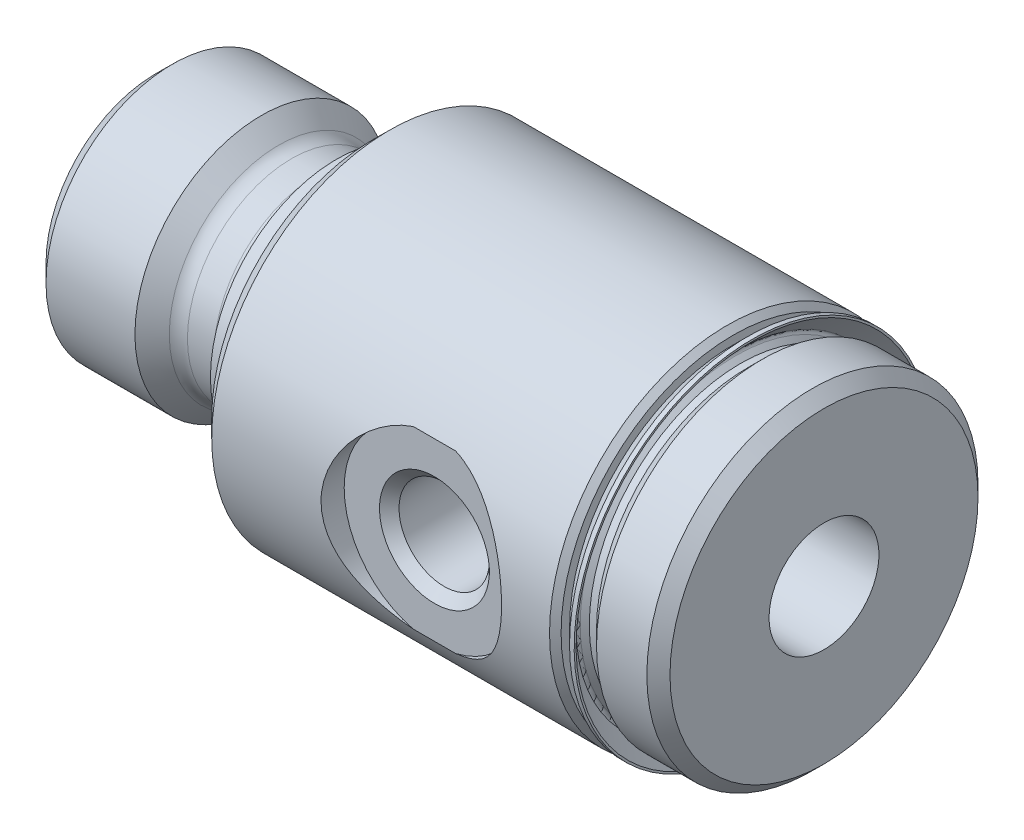
ISO-10303-21;
HEADER;
FILE_DESCRIPTION(('STEP AP214'),'2;1');
FILE_NAME('part.step','',(''),(''),'','','');
FILE_SCHEMA(('AUTOMOTIVE_DESIGN { 1 0 10303 214 1 1 1 1 }'));
ENDSEC;
DATA;
#1=APPLICATION_CONTEXT('core data for automotive mechanical design processes');
#2=APPLICATION_PROTOCOL_DEFINITION('international standard','automotive_design',2000,#1);
#3=PRODUCT_CONTEXT('',#1,'mechanical');
#4=PRODUCT('Part','Part','',(#3));
#5=PRODUCT_RELATED_PRODUCT_CATEGORY('part','',(#4));
#6=PRODUCT_DEFINITION_FORMATION('','',#4);
#7=PRODUCT_DEFINITION_CONTEXT('part definition',#1,'design');
#8=PRODUCT_DEFINITION('design','',#6,#7);
#9=PRODUCT_DEFINITION_SHAPE('','',#8);
#10=(LENGTH_UNIT() NAMED_UNIT(*) SI_UNIT(.MILLI.,.METRE.));
#11=(NAMED_UNIT(*) PLANE_ANGLE_UNIT() SI_UNIT($,.RADIAN.));
#12=(NAMED_UNIT(*) SI_UNIT($,.STERADIAN.) SOLID_ANGLE_UNIT());
#13=UNCERTAINTY_MEASURE_WITH_UNIT(LENGTH_MEASURE(1.E-05),#10,'distance_accuracy_value','');
#14=(GEOMETRIC_REPRESENTATION_CONTEXT(3) GLOBAL_UNCERTAINTY_ASSIGNED_CONTEXT((#13)) GLOBAL_UNIT_ASSIGNED_CONTEXT((#10,
#11,#12)) REPRESENTATION_CONTEXT('',''));
#15=CARTESIAN_POINT('',(0.,0.,0.));
#16=DIRECTION('',(0.,0.,1.));
#17=DIRECTION('',(1.,0.,0.));
#18=AXIS2_PLACEMENT_3D('',#15,#16,#17);
#19=CARTESIAN_POINT('',(29.3624,0.,0.));
#20=DIRECTION('',(-1.,0.,0.));
#21=DIRECTION('',(0.,0.,1.));
#22=AXIS2_PLACEMENT_3D('',#19,#20,#21);
#23=CYLINDRICAL_SURFACE('',#22,6.63575);
#24=CARTESIAN_POINT('',(26.0096,0.,0.));
#25=DIRECTION('',(-1.,0.,0.));
#26=DIRECTION('',(0.,0.,1.));
#27=AXIS2_PLACEMENT_3D('',#24,#25,#26);
#28=CIRCLE('',#27,6.63575);
#29=CARTESIAN_POINT('',(26.0096,0.,6.63575));
#30=VERTEX_POINT('',#29);
#31=EDGE_CURVE('E174',#30,#30,#28,.T.);
#32=ORIENTED_EDGE('',*,*,#31,.T.);
#33=EDGE_LOOP('',(#32));
#34=FACE_BOUND('',#33,.T.);
#35=CARTESIAN_POINT('',(25.6921000000003,-4.56834570172766E-13,0.));
#36=DIRECTION('',(-1.,0.,0.));
#37=DIRECTION('',(0.,-1.,0.));
#38=AXIS2_PLACEMENT_3D('',#35,#36,#37);
#39=CIRCLE('',#38,6.63575);
#40=CARTESIAN_POINT('',(25.6921000000002,-6.63575000000046,0.));
#41=VERTEX_POINT('',#40);
#42=EDGE_CURVE('E42',#41,#41,#39,.T.);
#43=ORIENTED_EDGE('',*,*,#42,.F.);
#44=EDGE_LOOP('',(#43));
#45=FACE_BOUND('',#44,.T.);
#46=ADVANCED_FACE('F34',(#34,#45),#23,.T.);
#47=CARTESIAN_POINT('',(29.3624,0.,0.));
#48=DIRECTION('',(-1.,0.,0.));
#49=DIRECTION('',(0.,0.,1.));
#50=AXIS2_PLACEMENT_3D('',#47,#48,#49);
#51=CYLINDRICAL_SURFACE('',#50,7.8105);
#52=CARTESIAN_POINT('',(10.287,0.,0.));
#53=DIRECTION('',(-1.,0.,0.));
#54=DIRECTION('',(0.,0.,1.));
#55=AXIS2_PLACEMENT_3D('',#52,#53,#54);
#56=CIRCLE('',#55,7.8105);
#57=CARTESIAN_POINT('',(10.287,0.,7.8105));
#58=VERTEX_POINT('',#57);
#59=EDGE_CURVE('E188',#58,#58,#56,.T.);
#60=ORIENTED_EDGE('',*,*,#59,.F.);
#61=EDGE_LOOP('',(#60));
#62=FACE_BOUND('',#61,.T.);
#63=CARTESIAN_POINT('',(25.1206,0.,0.));
#64=DIRECTION('',(-1.,0.,0.));
#65=DIRECTION('',(0.,0.,1.));
#66=AXIS2_PLACEMENT_3D('',#63,#64,#65);
#67=CIRCLE('',#66,7.8105);
#68=CARTESIAN_POINT('',(25.1206,0.,7.8105));
#69=VERTEX_POINT('',#68);
#70=EDGE_CURVE('E185',#69,#69,#67,.T.);
#71=ORIENTED_EDGE('',*,*,#70,.T.);
#72=EDGE_LOOP('',(#71));
#73=FACE_BOUND('',#72,.T.);
#74=DIRECTION('',(-1.,0.,0.));
#75=VECTOR('',#74,1.);
#76=CARTESIAN_POINT('',(29.3624,-3.85210072557819,6.7945));
#77=LINE('',#76,#75);
#78=CARTESIAN_POINT('',(18.1215961223692,-3.85210072557819,6.7945));
#79=VERTEX_POINT('',#78);
#80=CARTESIAN_POINT('',(19.9784038776308,-3.85210072557819,6.7945));
#81=VERTEX_POINT('',#80);
#82=EDGE_CURVE('E72',#79,#81,#77,.F.);
#83=ORIENTED_EDGE('',*,*,#82,.F.);
#84=CARTESIAN_POINT('',(18.1215961223692,3.85210072557819,6.7945));
#85=CARTESIAN_POINT('',(18.0128551494508,3.82589500564141,6.80934433204708));
#86=CARTESIAN_POINT('',(17.9056209649567,3.79517500586059,6.82657399668449));
#87=CARTESIAN_POINT('',(17.6948458436702,3.72511680182272,6.86506038601814));
#88=CARTESIAN_POINT('',(17.5913019230518,3.68578575285989,6.88631376526359));
#89=CARTESIAN_POINT('',(17.2878087065809,3.55577888639684,6.9548471368729));
#90=CARTESIAN_POINT('',(17.0940755421578,3.45286266206164,7.00703729481279));
#91=CARTESIAN_POINT('',(16.7281103611202,3.21817634438967,7.11786553311781));
#92=CARTESIAN_POINT('',(16.5558202225669,3.08648703832435,7.17648533571343));
#93=CARTESIAN_POINT('',(16.2347811190607,2.79677234095305,7.29427484256322));
#94=CARTESIAN_POINT('',(16.0860629837427,2.63871300579142,7.35344516154359));
#95=CARTESIAN_POINT('',(15.8070015488362,2.28841557588024,7.47015661481015));
#96=CARTESIAN_POINT('',(15.6784285339262,2.09464302317267,7.52735477020865));
#97=CARTESIAN_POINT('',(15.4562392511672,1.68511919200369,7.62946016123117));
#98=CARTESIAN_POINT('',(15.3625889509786,1.46938957321629,7.67437935130223));
#99=CARTESIAN_POINT('',(15.222598391159,1.04670163284468,7.74267421743849));
#100=CARTESIAN_POINT('',(15.1721871592955,0.841388849692406,7.76787617373968));
#101=CARTESIAN_POINT('',(15.1046975346992,0.424044677405603,7.80178403706623));
#102=CARTESIAN_POINT('',(15.0876021327686,0.212016772858686,7.81049836168719));
#103=CARTESIAN_POINT('',(15.0875979050919,-0.208253092440596,7.8105016092298));
#104=CARTESIAN_POINT('',(15.104087593126,-0.416495444900189,7.80209711836994));
#105=CARTESIAN_POINT('',(15.1692154971974,-0.826593665158206,7.76936300856744));
#106=CARTESIAN_POINT('',(15.217861199563,-1.02844803428297,7.7450296812023));
#107=CARTESIAN_POINT('',(15.3449093253086,-1.41953626393276,7.68296480855789));
#108=CARTESIAN_POINT('',(15.4232143015947,-1.60880909321737,7.645277165452));
#109=CARTESIAN_POINT('',(15.6067613235194,-1.97130408916965,7.55993347529357));
#110=CARTESIAN_POINT('',(15.7120099406,-2.14452232613126,7.51227499691478));
#111=CARTESIAN_POINT('',(15.9538052593816,-2.48190984333818,7.40790858770927));
#112=CARTESIAN_POINT('',(16.0918793620173,-2.64486639030063,7.35082425979542));
#113=CARTESIAN_POINT('',(16.3921031272662,-2.94644852490168,7.23522519139544));
#114=CARTESIAN_POINT('',(16.5542737306898,-3.08505271842146,7.17670924409722));
#115=CARTESIAN_POINT('',(16.9000859546562,-3.3352651062674,7.06390731868926));
#116=CARTESIAN_POINT('',(17.0837507646518,-3.44684373778793,7.00962601637755));
#117=CARTESIAN_POINT('',(17.3722265046765,-3.59127493866339,6.93610629540564));
#118=CARTESIAN_POINT('',(17.470460770679,-3.63556844811676,6.91293281761722));
#119=CARTESIAN_POINT('',(17.6708258445217,-3.71619801837318,6.86992504364546));
#120=CARTESIAN_POINT('',(17.7729539079885,-3.75253956633275,6.85008844708623));
#121=CARTESIAN_POINT('',(17.9170538936038,-3.79721428881743,6.82534082601764));
#122=CARTESIAN_POINT('',(17.9576644911665,-3.80909600866532,6.81871427962771));
#123=CARTESIAN_POINT('',(18.0393123286186,-3.83156813434324,6.80611204807017));
#124=CARTESIAN_POINT('',(18.0803492748927,-3.84215937221748,6.80013594379516));
#125=CARTESIAN_POINT('',(18.1215961223692,-3.85210072557819,6.7945));
#126=B_SPLINE_CURVE_WITH_KNOTS('',3,(#84,#85,#86,#87,#88,#89,#90,#91,#92,#93,#94,#95,#96,#97,
#98,#99,#100,#101,#102,#103,#104,#105,#106,#107,#108,#109,#110,#111,#112,#113,#114,#115,#116,
#117,#118,#119,#120,#121,#122,#123,#124,#125),.UNSPECIFIED.,.F.,.F.,(4,2,2,2,2,2,2,2,2,2,2,2,2,
2,2,2,2,2,2,2,4),(0.,0.338222818675507,0.676165652849872,1.34921264078913,2.02039363276876,
2.69244533968194,3.40724108890215,4.12133843480017,4.7568840992762,5.39210520461711,
6.01604998873544,6.64014008630427,7.26219724397963,7.88440626359151,8.54490302049852,
9.20597716914358,9.86777122242373,10.1981171851282,10.5282344725933,10.6567002766157,
10.7850828084273),.UNSPECIFIED.);
#127=CARTESIAN_POINT('',(18.1215961223692,3.85210072557819,6.7945));
#128=VERTEX_POINT('',#127);
#129=EDGE_CURVE('E52',#128,#79,#126,.T.);
#130=ORIENTED_EDGE('',*,*,#129,.F.);
#131=DIRECTION('',(-1.,0.,0.));
#132=VECTOR('',#131,1.);
#133=CARTESIAN_POINT('',(29.3624,3.85210072557819,6.7945));
#134=LINE('',#133,#132);
#135=CARTESIAN_POINT('',(19.9784038776308,3.85210072557819,6.7945));
#136=VERTEX_POINT('',#135);
#137=EDGE_CURVE('E68',#136,#128,#134,.T.);
#138=ORIENTED_EDGE('',*,*,#137,.F.);
#139=CARTESIAN_POINT('',(19.9784038776308,-3.85210072557819,6.7945));
#140=CARTESIAN_POINT('',(20.0871441476983,-3.82589544686892,6.80934420874089));
#141=CARTESIAN_POINT('',(20.1943778263773,-3.79517548526653,6.82657379028904));
#142=CARTESIAN_POINT('',(20.4051519641891,-3.72511745285641,6.86505997155541));
#143=CARTESIAN_POINT('',(20.5086954076075,-3.68578653845436,6.88631322530072));
#144=CARTESIAN_POINT('',(20.8121889417393,-3.55578060620908,6.95484648081365));
#145=CARTESIAN_POINT('',(21.0059222633617,-3.45286628823122,7.00703655483552));
#146=CARTESIAN_POINT('',(21.3718946574185,-3.21817091332426,7.11786712811991));
#147=CARTESIAN_POINT('',(21.5441915172288,-3.08647022469434,7.17648944675929));
#148=CARTESIAN_POINT('',(21.8652206001147,-2.79677701729546,7.29427566912562));
#149=CARTESIAN_POINT('',(22.0139229679327,-2.63875169860474,7.35344016037897));
#150=CARTESIAN_POINT('',(22.2930004460401,-2.28839067605302,7.47015651935842));
#151=CARTESIAN_POINT('',(22.4216119254221,-2.0945133665992,7.52736735939915));
#152=CARTESIAN_POINT('',(22.5882521642072,-1.78745629875584,7.60395461709459));
#153=CARTESIAN_POINT('',(22.6394307437685,-1.68236335543616,7.62795130954219));
#154=CARTESIAN_POINT('',(22.7325253651758,-1.467415909354,7.67219678193279));
#155=CARTESIAN_POINT('',(22.7744464910334,-1.35756405994036,7.69244761802928));
#156=CARTESIAN_POINT('',(22.8463423582829,-1.14048258055078,7.72752147938978));
#157=CARTESIAN_POINT('',(22.8768734567333,-1.03347688643543,7.74259314428561));
#158=CARTESIAN_POINT('',(22.9288925199877,-0.816827347829265,7.76843568198634));
#159=CARTESIAN_POINT('',(22.9503849783784,-0.707184842968009,7.77920869174365));
#160=CARTESIAN_POINT('',(22.9840506327867,-0.486160747751186,7.79614258259886));
#161=CARTESIAN_POINT('',(22.9962268423637,-0.374779731663944,7.80230495510138));
#162=CARTESIAN_POINT('',(23.0110970240145,-0.151228170032666,7.80983636785463));
#163=CARTESIAN_POINT('',(23.0137917464325,-0.0390576876692567,7.81120578740914));
#164=CARTESIAN_POINT('',(23.0098626942883,0.174230727152886,7.80921306572696));
#165=CARTESIAN_POINT('',(23.0041134263872,0.275370230556359,7.80629495337318));
#166=CARTESIAN_POINT('',(22.9849140365282,0.476760563041052,7.79658748131316));
#167=CARTESIAN_POINT('',(22.9714614433281,0.577011096453566,7.78979687930726));
#168=CARTESIAN_POINT('',(22.9370107815293,0.77584386949125,7.77251093312911));
#169=CARTESIAN_POINT('',(22.9160156536495,0.87442674364788,7.76201703284431));
#170=CARTESIAN_POINT('',(22.866711471725,1.06932194629943,7.73757915700026));
#171=CARTESIAN_POINT('',(22.8383996096475,1.16563338753836,7.72363385694216));
#172=CARTESIAN_POINT('',(22.7429622417522,1.45000298576464,7.67711751193974));
#173=CARTESIAN_POINT('',(22.6652689288464,1.63387127553528,7.63983166466624));
#174=CARTESIAN_POINT('',(22.4844105074451,1.98613907629759,7.55592978822106));
#175=CARTESIAN_POINT('',(22.3812378745803,2.15453399761335,7.50931100368502));
#176=CARTESIAN_POINT('',(22.1415879893032,2.48767198577415,7.40597608662514));
#177=CARTESIAN_POINT('',(22.0029338281294,2.65068693044985,7.34872708336746));
#178=CARTESIAN_POINT('',(21.7014854689175,2.95225332865383,7.2328606753409));
#179=CARTESIAN_POINT('',(21.5386683630018,3.09078129100682,7.17424201698428));
#180=CARTESIAN_POINT('',(21.1919493818625,3.34037993308468,7.0614808768916));
#181=CARTESIAN_POINT('',(21.0080772310669,3.45148863901217,7.00733226609806));
#182=CARTESIAN_POINT('',(20.7193479654856,3.59519821350267,6.93407158259833));
#183=CARTESIAN_POINT('',(20.6210409964459,3.63924791955856,6.91099474451808));
#184=CARTESIAN_POINT('',(20.4205507786716,3.71938598222266,6.86819783346444));
#185=CARTESIAN_POINT('',(20.3183702846579,3.7554798767184,6.84847542773293));
#186=CARTESIAN_POINT('',(20.1756487853758,3.79936734605261,6.8241412914012));
#187=CARTESIAN_POINT('',(20.1364755120194,3.81075500048536,6.81778630014991));
#188=CARTESIAN_POINT('',(20.0577343126525,3.83232947195563,6.8056824487551));
#189=CARTESIAN_POINT('',(20.0181666526235,3.84251704581508,6.79993320684443));
#190=CARTESIAN_POINT('',(19.9784038776308,3.85210072557826,6.79450000000023));
#191=B_SPLINE_CURVE_WITH_KNOTS('',3,(#139,#140,#141,#142,#143,#144,#145,#146,#147,#148,#149,
#150,#151,#152,#153,#154,#155,#156,#157,#158,#159,#160,#161,#162,#163,#164,#165,#166,#167,#168,
#169,#170,#171,#172,#173,#174,#175,#176,#177,#178,#179,#180,#181,#182,#183,#184,#185,#186,#187,
#188,#189,#190),.UNSPECIFIED.,.F.,.F.,(4,2,2,2,2,2,2,2,2,2,2,2,2,2,2,2,2,2,2,2,2,2,2,2,2,4),(0.,
0.338221009541507,0.67616198963787,1.34921263131612,2.02040766224254,2.69244533008579,
3.40716181306005,3.76473320700904,4.12210773870362,4.45852719349784,4.7947791980813,
5.13092238801829,5.46703897572,5.77070634470169,6.07447118541031,6.37811772116265,
6.68188096457572,7.28827462636846,7.89484757855808,8.55664209811417,9.21906809364816,
9.88057017933557,10.210756651782,10.5407125568174,10.664555135566,10.7883191909823),.UNSPECIFIED.);
#192=EDGE_CURVE('E60',#81,#136,#191,.T.);
#193=ORIENTED_EDGE('',*,*,#192,.F.);
#194=EDGE_LOOP('',(#83,#130,#138,#193));
#195=FACE_BOUND('',#194,.T.);
#196=ADVANCED_FACE('F75',(#62,#73,#195),#51,.T.);
#197=CARTESIAN_POINT('',(29.3624,0.,0.));
#198=DIRECTION('',(-1.,0.,0.));
#199=DIRECTION('',(0.,0.,1.));
#200=AXIS2_PLACEMENT_3D('',#197,#198,#199);
#201=CYLINDRICAL_SURFACE('',#200,2.413);
#202=CARTESIAN_POINT('',(29.3624,0.,0.));
#203=DIRECTION('',(-1.,0.,0.));
#204=DIRECTION('',(0.,0.,1.));
#205=AXIS2_PLACEMENT_3D('',#202,#203,#204);
#206=CIRCLE('',#205,2.413);
#207=CARTESIAN_POINT('',(29.3624,0.,2.413));
#208=VERTEX_POINT('',#207);
#209=EDGE_CURVE('E421',#208,#208,#206,.T.);
#210=ORIENTED_EDGE('',*,*,#209,.F.);
#211=EDGE_LOOP('',(#210));
#212=FACE_BOUND('',#211,.T.);
#213=CARTESIAN_POINT('',(0.508000000000002,0.,0.));
#214=DIRECTION('',(-1.,0.,0.));
#215=DIRECTION('',(0.,0.,1.));
#216=AXIS2_PLACEMENT_3D('',#213,#214,#215);
#217=CIRCLE('',#216,2.413);
#218=CARTESIAN_POINT('',(0.508000000000002,0.,2.413));
#219=VERTEX_POINT('',#218);
#220=EDGE_CURVE('E424',#219,#219,#217,.T.);
#221=ORIENTED_EDGE('',*,*,#220,.T.);
#222=EDGE_LOOP('',(#221));
#223=FACE_BOUND('',#222,.T.);
#224=CARTESIAN_POINT('',(21.03374,0.,2.413));
#225=CARTESIAN_POINT('',(21.0337319164341,0.0945220466073646,2.41299211856903));
#226=CARTESIAN_POINT('',(21.0269292239376,0.189147437233285,2.40739120060085));
#227=CARTESIAN_POINT('',(21.0001923929391,0.3753111322332,2.38548503970721));
#228=CARTESIAN_POINT('',(20.9802357586433,0.46684386514418,2.36916145911039));
#229=CARTESIAN_POINT('',(20.9286651778364,0.643638686775527,2.32733774653844));
#230=CARTESIAN_POINT('',(20.8971247953411,0.728936359771254,2.30189554755293));
#231=CARTESIAN_POINT('',(20.823991118228,0.89230301029301,2.24363620468909));
#232=CARTESIAN_POINT('',(20.7823964462025,0.970370995344804,2.21081805037016));
#233=CARTESIAN_POINT('',(20.6740557864053,1.14531283453237,2.12681153861027));
#234=CARTESIAN_POINT('',(20.6036519026973,1.23879348743713,2.07326959916021));
#235=CARTESIAN_POINT('',(20.4496915342449,1.41048196550803,1.96053949740092));
#236=CARTESIAN_POINT('',(20.3660977786655,1.48864506019885,1.90133552841052));
#237=CARTESIAN_POINT('',(20.1855560195606,1.63069711653558,1.78105240463844));
#238=CARTESIAN_POINT('',(20.088399202088,1.69431117584161,1.71995857911439));
#239=CARTESIAN_POINT('',(19.9335919509996,1.77704539126499,1.63288039902576));
#240=CARTESIAN_POINT('',(19.8805234469718,1.80249373555696,1.60463547220708));
#241=CARTESIAN_POINT('',(19.7711882851122,1.84895642164053,1.55086571898795));
#242=CARTESIAN_POINT('',(19.7149244313098,1.86997457702649,1.5253385625238));
#243=CARTESIAN_POINT('',(19.592571248157,1.90929753372179,1.4758928162836));
#244=CARTESIAN_POINT('',(19.5260876211354,1.92703376992684,1.45247560342758));
#245=CARTESIAN_POINT('',(19.3894905949824,1.95571394435062,1.41362735121574));
#246=CARTESIAN_POINT('',(19.3193866983944,1.96667477376333,1.39817646778005));
#247=CARTESIAN_POINT('',(19.1760129642332,1.98105328586897,1.37774131582023));
#248=CARTESIAN_POINT('',(19.1027169207774,1.98438732156138,1.37287314187836));
#249=CARTESIAN_POINT('',(18.956377269352,1.98288179829234,1.37504456584978));
#250=CARTESIAN_POINT('',(18.8833337657758,1.97803918912158,1.38208860748833));
#251=CARTESIAN_POINT('',(18.7320713375693,1.95974360718956,1.40791896838486));
#252=CARTESIAN_POINT('',(18.6541824709674,1.94539144628207,1.42792608296798));
#253=CARTESIAN_POINT('',(18.5032207032972,1.9084908802625,1.47687458559969));
#254=CARTESIAN_POINT('',(18.4301640501746,1.88591633425052,1.50584442352083));
#255=CARTESIAN_POINT('',(18.30478856196,1.83937826696517,1.56214114090541));
#256=CARTESIAN_POINT('',(18.2514511693482,1.81682066694284,1.58841973823639));
#257=CARTESIAN_POINT('',(18.1477611879925,1.76762056500372,1.64299745298747));
#258=CARTESIAN_POINT('',(18.0974102417775,1.74097584355795,1.67129766376483));
#259=CARTESIAN_POINT('',(17.9505907884788,1.65511616364806,1.75776297892959));
#260=CARTESIAN_POINT('',(17.8584088520246,1.58999588490262,1.81746671243101));
#261=CARTESIAN_POINT('',(17.6820718330815,1.44146919871993,1.9375985274472));
#262=CARTESIAN_POINT('',(17.5984178491116,1.35740854045678,1.99795134343658));
#263=CARTESIAN_POINT('',(17.4457009697707,1.17290528928988,2.1115240684516));
#264=CARTESIAN_POINT('',(17.376603360284,1.07250270704212,2.16476083434941));
#265=CARTESIAN_POINT('',(17.2723000399726,0.885022621847723,2.24651324006223));
#266=CARTESIAN_POINT('',(17.2329657335471,0.801470249055037,2.27784094331493));
#267=CARTESIAN_POINT('',(17.1657199781008,0.627225000810244,2.33183430716342));
#268=CARTESIAN_POINT('',(17.1378005901926,0.536537140494629,2.35450598715198));
#269=CARTESIAN_POINT('',(17.0949205066698,0.349494301502011,2.38946118723347));
#270=CARTESIAN_POINT('',(17.0800475738688,0.25310552892035,2.40167434050914));
#271=CARTESIAN_POINT('',(17.0647222342662,0.0584256803141275,2.41426007788975));
#272=CARTESIAN_POINT('',(17.0642631824537,-0.0398644982211786,2.41463811815538));
#273=CARTESIAN_POINT('',(17.0770559593979,-0.224418212344718,2.40413057695339));
#274=CARTESIAN_POINT('',(17.0888669166965,-0.310856895278865,2.3944286751166));
#275=CARTESIAN_POINT('',(17.1232880215982,-0.480065558441525,2.36631892096216));
#276=CARTESIAN_POINT('',(17.1459000238871,-0.562834905926934,2.34790957346336));
#277=CARTESIAN_POINT('',(17.2016317757834,-0.725531413907151,2.30293935373151));
#278=CARTESIAN_POINT('',(17.2350653303633,-0.80528222858228,2.27613593609942));
#279=CARTESIAN_POINT('',(17.3107593245615,-0.957878335156865,2.2162510501576));
#280=CARTESIAN_POINT('',(17.3530224549576,-1.03072151212021,2.18316766833567));
#281=CARTESIAN_POINT('',(17.4659591326648,-1.2002494624583,2.09635013380068));
#282=CARTESIAN_POINT('',(17.540837787416,-1.29282045036667,2.04004267093594));
#283=CARTESIAN_POINT('',(17.7040659725232,-1.4620522332776,1.9224000827249));
#284=CARTESIAN_POINT('',(17.7924653544502,-1.53865156305511,1.86104675680259));
#285=CARTESIAN_POINT('',(17.9349735140002,-1.64178158824449,1.76898443324214));
#286=CARTESIAN_POINT('',(17.9846036425766,-1.67442746044566,1.73802240384765));
#287=CARTESIAN_POINT('',(18.0871158668483,-1.73540769775945,1.67713501478611));
#288=CARTESIAN_POINT('',(18.1399994280344,-1.76374009962966,1.64721013192553));
#289=CARTESIAN_POINT('',(18.2488749923797,-1.81577758657095,1.58966014060259));
#290=CARTESIAN_POINT('',(18.3048532015648,-1.8395013661906,1.56202601320165));
#291=CARTESIAN_POINT('',(18.42018578155,-1.88210846847816,1.5104154015603));
#292=CARTESIAN_POINT('',(18.4795358990256,-1.9009977307296,1.48643444392775));
#293=CARTESIAN_POINT('',(18.6044001341805,-1.93417098885845,1.44302943174754));
#294=CARTESIAN_POINT('',(18.6700713672162,-1.94821011088564,1.4238583455145));
#295=CARTESIAN_POINT('',(18.8042987096678,-1.96963175022882,1.39408258648696));
#296=CARTESIAN_POINT('',(18.8728468727203,-1.97703148337786,1.38345576602904));
#297=CARTESIAN_POINT('',(19.0117076108353,-1.98459455364801,1.37259127183297));
#298=CARTESIAN_POINT('',(19.0820292544989,-1.98470616912906,1.37242785396223));
#299=CARTESIAN_POINT('',(19.2215460685279,-1.97754756857666,1.38271666022164));
#300=CARTESIAN_POINT('',(19.2907395179489,-1.97026698401266,1.39318379510266));
#301=CARTESIAN_POINT('',(19.4424980520981,-1.94638829516886,1.42640865349344));
#302=CARTESIAN_POINT('',(19.5242333396488,-1.92795785915136,1.45153252989753));
#303=CARTESIAN_POINT('',(19.6819665407168,-1.88218906975942,1.51040202515826));
#304=CARTESIAN_POINT('',(19.7579454251762,-1.85482263506092,1.54417474983995));
#305=CARTESIAN_POINT('',(19.887209505272,-1.79945372218492,1.60807163450478));
#306=CARTESIAN_POINT('',(19.9416827282057,-1.77305836931007,1.63723655755074));
#307=CARTESIAN_POINT('',(20.0473682137797,-1.71583602448893,1.69711374170356));
#308=CARTESIAN_POINT('',(20.0985788556704,-1.68500685435054,1.72782675849389));
#309=CARTESIAN_POINT('',(20.2475188187902,-1.58600546688503,1.82080314514998));
#310=CARTESIAN_POINT('',(20.3405270188704,-1.51133205760193,1.88388826734455));
#311=CARTESIAN_POINT('',(20.5151208587475,-1.34301732922408,2.00750921428922));
#312=CARTESIAN_POINT('',(20.5963798692619,-1.24896484345984,2.06794789959626));
#313=CARTESIAN_POINT('',(20.7418089874597,-1.04342062045598,2.17884447298023));
#314=CARTESIAN_POINT('',(20.806029301654,-0.931981690870637,2.22933156896315));
#315=CARTESIAN_POINT('',(20.8957916889247,-0.732208620521961,2.30083097393904));
#316=CARTESIAN_POINT('',(20.9271300357916,-0.647980069261661,2.32610002720196));
#317=CARTESIAN_POINT('',(20.9783768796747,-0.474078253444637,2.36764702174729));
#318=CARTESIAN_POINT('',(20.9983116494065,-0.384418034749235,2.38394562674608));
#319=CARTESIAN_POINT('',(21.0191646294344,-0.244973059040387,2.40102883489277));
#320=CARTESIAN_POINT('',(21.0246170887032,-0.196261973967068,2.40550469638764));
#321=CARTESIAN_POINT('',(21.0319073481975,-0.0983766714115401,2.41149271584661));
#322=CARTESIAN_POINT('',(21.0337442078049,-0.0492023367547452,2.41300410258595));
#323=CARTESIAN_POINT('',(21.03374,0.,2.413));
#324=B_SPLINE_CURVE_WITH_KNOTS('',3,(#224,#225,#226,#227,#228,#229,#230,#231,#232,#233,#234,
#235,#236,#237,#238,#239,#240,#241,#242,#243,#244,#245,#246,#247,#248,#249,#250,#251,#252,#253,
#254,#255,#256,#257,#258,#259,#260,#261,#262,#263,#264,#265,#266,#267,#268,#269,#270,#271,#272,
#273,#274,#275,#276,#277,#278,#279,#280,#281,#282,#283,#284,#285,#286,#287,#288,#289,#290,#291,
#292,#293,#294,#295,#296,#297,#298,#299,#300,#301,#302,#303,#304,#305,#306,#307,#308,#309,#310,
#311,#312,#313,#314,#315,#316,#317,#318,#319,#320,#321,#322,#323),.UNSPECIFIED.,.T.,.F.,(4,2,2,
2,2,2,2,2,2,2,2,2,2,2,2,2,2,2,2,2,2,2,2,2,2,2,2,2,2,2,2,2,2,2,2,2,2,2,2,2,2,2,2,2,2,2,2,2,2,4),
(0.,0.283353299834322,0.567192450539977,0.849259364459221,1.13136494262671,1.51537236218872,
1.90048497909261,2.29236349277855,2.48799104588622,2.68344950489633,2.90082610431943,
3.11765857153192,3.33685797997353,3.55613917646064,3.79985092529844,4.04434435257937,
4.23488233670916,4.42552416205109,4.80699340157053,5.20451727157107,5.60108211541298,
5.89250256623595,6.18371999275439,6.47688172323535,6.76990829986733,7.0320317022332,
7.29420013093022,7.56477854787263,7.83543954309157,8.22849105791324,8.62302835489587,
8.82381836105272,9.02469948375262,9.22474790388541,9.4245493561171,9.63332241507778,
9.84155255102693,10.0512602759238,10.2612625503196,10.5222258442336,10.7840172357897,
10.9853368083021,11.1867556226545,11.5896982605348,12.0022839945915,12.4136401438245,
12.692616592414,12.9709476910481,13.1184055530614,13.2659017719798),.UNSPECIFIED.);
#325=CARTESIAN_POINT('',(21.03374,0.,2.413));
#326=VERTEX_POINT('',#325);
#327=EDGE_CURVE('E119',#326,#326,#324,.T.);
#328=ORIENTED_EDGE('',*,*,#327,.T.);
#329=EDGE_LOOP('',(#328));
#330=FACE_BOUND('',#329,.T.);
#331=ADVANCED_FACE('F95',(#212,#223,#330),#201,.F.);
#332=CARTESIAN_POINT('',(9.525,0.,0.));
#333=DIRECTION('',(-1.,0.,0.));
#334=DIRECTION('',(0.,0.,1.));
#335=AXIS2_PLACEMENT_3D('',#332,#333,#334);
#336=CYLINDRICAL_SURFACE('',#335,5.53085);
#337=CARTESIAN_POINT('',(7.9502,0.,0.));
#338=DIRECTION('',(-1.,0.,0.));
#339=DIRECTION('',(0.,0.,1.));
#340=AXIS2_PLACEMENT_3D('',#337,#338,#339);
#341=CIRCLE('',#340,5.53085);
#342=CARTESIAN_POINT('',(7.9502,0.,5.53085));
#343=VERTEX_POINT('',#342);
#344=EDGE_CURVE('E118',#343,#343,#341,.T.);
#345=ORIENTED_EDGE('',*,*,#344,.F.);
#346=EDGE_LOOP('',(#345));
#347=FACE_BOUND('',#346,.T.);
#348=CARTESIAN_POINT('',(9.525,0.,0.));
#349=DIRECTION('',(1.,0.,0.));
#350=DIRECTION('',(0.,0.,-1.));
#351=AXIS2_PLACEMENT_3D('',#348,#349,#350);
#352=CIRCLE('',#351,5.53085);
#353=CARTESIAN_POINT('',(9.525,0.,-5.53085));
#354=VERTEX_POINT('',#353);
#355=EDGE_CURVE('E194',#354,#354,#352,.T.);
#356=ORIENTED_EDGE('',*,*,#355,.F.);
#357=EDGE_LOOP('',(#356));
#358=FACE_BOUND('',#357,.T.);
#359=ADVANCED_FACE('F36',(#347,#358),#336,.T.);
#360=CARTESIAN_POINT('',(7.9502,5.3721,0.));
#361=DIRECTION('',(1.,0.,0.));
#362=DIRECTION('',(0.,0.,-1.));
#363=AXIS2_PLACEMENT_3D('',#360,#361,#362);
#364=PLANE('',#363);
#365=CARTESIAN_POINT('',(7.9502,0.,0.));
#366=DIRECTION('',(-1.,0.,0.));
#367=DIRECTION('',(0.,0.,1.));
#368=AXIS2_PLACEMENT_3D('',#365,#366,#367);
#369=CIRCLE('',#368,5.3721);
#370=CARTESIAN_POINT('',(7.9502,0.,5.3721));
#371=VERTEX_POINT('',#370);
#372=EDGE_CURVE('E215',#371,#371,#369,.T.);
#373=ORIENTED_EDGE('',*,*,#372,.F.);
#374=EDGE_LOOP('',(#373));
#375=FACE_BOUND('',#374,.T.);
#376=ORIENTED_EDGE('',*,*,#344,.T.);
#377=EDGE_LOOP('',(#376));
#378=FACE_BOUND('',#377,.T.);
#379=ADVANCED_FACE('F220',(#375,#378),#364,.F.);
#380=CARTESIAN_POINT('',(7.15010000000015,0.,0.));
#381=DIRECTION('',(-1.,0.,0.));
#382=DIRECTION('',(0.,0.,1.));
#383=AXIS2_PLACEMENT_3D('',#380,#381,#382);
#384=TOROIDAL_SURFACE('',#383,5.37209999999985,0.800099999999851);
#385=CARTESIAN_POINT('',(7.1501,0.,0.));
#386=DIRECTION('',(-1.,0.,0.));
#387=DIRECTION('',(0.,0.,1.));
#388=AXIS2_PLACEMENT_3D('',#385,#386,#387);
#389=CIRCLE('',#388,4.572);
#390=CARTESIAN_POINT('',(7.1501,0.,4.572));
#391=VERTEX_POINT('',#390);
#392=EDGE_CURVE('E212',#391,#391,#389,.T.);
#393=ORIENTED_EDGE('',*,*,#392,.F.);
#394=EDGE_LOOP('',(#393));
#395=FACE_BOUND('',#394,.T.);
#396=ORIENTED_EDGE('',*,*,#372,.T.);
#397=EDGE_LOOP('',(#396));
#398=FACE_BOUND('',#397,.T.);
#399=ADVANCED_FACE('F457',(#395,#398),#384,.F.);
#400=CARTESIAN_POINT('',(9.525,0.,0.));
#401=DIRECTION('',(-1.,0.,0.));
#402=DIRECTION('',(0.,0.,1.));
#403=AXIS2_PLACEMENT_3D('',#400,#401,#402);
#404=CYLINDRICAL_SURFACE('',#403,4.572);
#405=CARTESIAN_POINT('',(5.9817,0.,0.));
#406=DIRECTION('',(-1.,0.,0.));
#407=DIRECTION('',(0.,0.,1.));
#408=AXIS2_PLACEMENT_3D('',#405,#406,#407);
#409=CIRCLE('',#408,4.572);
#410=CARTESIAN_POINT('',(5.9817,0.,4.572));
#411=VERTEX_POINT('',#410);
#412=EDGE_CURVE('E209',#411,#411,#409,.T.);
#413=ORIENTED_EDGE('',*,*,#412,.F.);
#414=EDGE_LOOP('',(#413));
#415=FACE_BOUND('',#414,.T.);
#416=ORIENTED_EDGE('',*,*,#392,.T.);
#417=EDGE_LOOP('',(#416));
#418=FACE_BOUND('',#417,.T.);
#419=ADVANCED_FACE('F451',(#415,#418),#404,.T.);
#420=CARTESIAN_POINT('',(5.98170000000007,0.,0.));
#421=DIRECTION('',(-1.,0.,0.));
#422=DIRECTION('',(0.,0.,1.));
#423=AXIS2_PLACEMENT_3D('',#420,#421,#422);
#424=TOROIDAL_SURFACE('',#423,5.37210000000021,0.800100000000209);
#425=CARTESIAN_POINT('',(5.4181032913718,0.,0.));
#426=DIRECTION('',(-1.,0.,0.));
#427=DIRECTION('',(0.,0.,1.));
#428=AXIS2_PLACEMENT_3D('',#425,#426,#427);
#429=CIRCLE('',#428,4.8041926483805);
#430=CARTESIAN_POINT('',(5.4181032913718,0.,4.8041926483805));
#431=VERTEX_POINT('',#430);
#432=EDGE_CURVE('E206',#431,#431,#429,.T.);
#433=ORIENTED_EDGE('',*,*,#432,.F.);
#434=EDGE_LOOP('',(#433));
#435=FACE_BOUND('',#434,.T.);
#436=ORIENTED_EDGE('',*,*,#412,.T.);
#437=EDGE_LOOP('',(#436));
#438=FACE_BOUND('',#437,.T.);
#439=ADVANCED_FACE('F445',(#435,#438),#424,.F.);
#440=CARTESIAN_POINT('',(5.4181032913718,0.,0.));
#441=DIRECTION('',(-1.,0.,0.));
#442=DIRECTION('',(0.,0.,1.));
#443=AXIS2_PLACEMENT_3D('',#440,#441,#442);
#444=CONICAL_SURFACE('',#443,4.8041926483805,0.781588524273101);
#445=CARTESIAN_POINT('',(4.6602938643726,0.,0.));
#446=DIRECTION('',(-1.,0.,0.));
#447=DIRECTION('',(0.,0.,1.));
#448=AXIS2_PLACEMENT_3D('',#445,#446,#447);
#449=CIRCLE('',#448,5.55625);
#450=CARTESIAN_POINT('',(4.6602938643726,0.,5.55625));
#451=VERTEX_POINT('',#450);
#452=EDGE_CURVE('E203',#451,#451,#449,.T.);
#453=ORIENTED_EDGE('',*,*,#452,.F.);
#454=EDGE_LOOP('',(#453));
#455=FACE_BOUND('',#454,.T.);
#456=ORIENTED_EDGE('',*,*,#432,.T.);
#457=EDGE_LOOP('',(#456));
#458=FACE_BOUND('',#457,.T.);
#459=ADVANCED_FACE('F439',(#455,#458),#444,.T.);
#460=CARTESIAN_POINT('',(9.525,0.,0.));
#461=DIRECTION('',(-1.,0.,0.));
#462=DIRECTION('',(0.,0.,1.));
#463=AXIS2_PLACEMENT_3D('',#460,#461,#462);
#464=CYLINDRICAL_SURFACE('',#463,5.55625);
#465=CARTESIAN_POINT('',(0.75565,0.,0.));
#466=DIRECTION('',(-1.,0.,0.));
#467=DIRECTION('',(0.,0.,1.));
#468=AXIS2_PLACEMENT_3D('',#465,#466,#467);
#469=CIRCLE('',#468,5.55625);
#470=CARTESIAN_POINT('',(0.75565,0.,5.55625));
#471=VERTEX_POINT('',#470);
#472=EDGE_CURVE('E200',#471,#471,#469,.T.);
#473=ORIENTED_EDGE('',*,*,#472,.F.);
#474=EDGE_LOOP('',(#473));
#475=FACE_BOUND('',#474,.T.);
#476=ORIENTED_EDGE('',*,*,#452,.T.);
#477=EDGE_LOOP('',(#476));
#478=FACE_BOUND('',#477,.T.);
#479=ADVANCED_FACE('F433',(#475,#478),#464,.T.);
#480=CARTESIAN_POINT('',(0.75565,0.,0.));
#481=DIRECTION('',(1.,0.,0.));
#482=DIRECTION('',(0.,0.,-1.));
#483=AXIS2_PLACEMENT_3D('',#480,#481,#482);
#484=CONICAL_SURFACE('',#483,5.55625,0.785398163397448);
#485=CARTESIAN_POINT('',(0.,0.,0.));
#486=DIRECTION('',(-1.,0.,0.));
#487=DIRECTION('',(0.,0.,1.));
#488=AXIS2_PLACEMENT_3D('',#485,#486,#487);
#489=CIRCLE('',#488,4.8006);
#490=CARTESIAN_POINT('',(0.,0.,4.8006));
#491=VERTEX_POINT('',#490);
#492=EDGE_CURVE('E197',#491,#491,#489,.T.);
#493=ORIENTED_EDGE('',*,*,#492,.F.);
#494=EDGE_LOOP('',(#493));
#495=FACE_BOUND('',#494,.T.);
#496=ORIENTED_EDGE('',*,*,#472,.T.);
#497=EDGE_LOOP('',(#496));
#498=FACE_BOUND('',#497,.T.);
#499=ADVANCED_FACE('F277',(#495,#498),#484,.T.);
#500=CARTESIAN_POINT('',(0.,0.,0.));
#501=DIRECTION('',(1.,0.,0.));
#502=DIRECTION('',(0.,0.,-1.));
#503=AXIS2_PLACEMENT_3D('',#500,#501,#502);
#504=PLANE('',#503);
#505=CARTESIAN_POINT('',(0.,0.,0.));
#506=DIRECTION('',(-1.,0.,0.));
#507=DIRECTION('',(0.,0.,1.));
#508=AXIS2_PLACEMENT_3D('',#505,#506,#507);
#509=CIRCLE('',#508,2.921);
#510=CARTESIAN_POINT('',(0.,0.,2.921));
#511=VERTEX_POINT('',#510);
#512=EDGE_CURVE('E177',#511,#511,#509,.T.);
#513=ORIENTED_EDGE('',*,*,#512,.F.);
#514=EDGE_LOOP('',(#513));
#515=FACE_BOUND('',#514,.T.);
#516=ORIENTED_EDGE('',*,*,#492,.T.);
#517=EDGE_LOOP('',(#516));
#518=FACE_BOUND('',#517,.T.);
#519=ADVANCED_FACE('F229',(#515,#518),#504,.F.);
#520=CARTESIAN_POINT('',(9.525,0.,0.));
#521=DIRECTION('',(1.,0.,0.));
#522=DIRECTION('',(0.,0.,-1.));
#523=AXIS2_PLACEMENT_3D('',#520,#521,#522);
#524=PLANE('',#523);
#525=ORIENTED_EDGE('',*,*,#355,.T.);
#526=EDGE_LOOP('',(#525));
#527=FACE_BOUND('',#526,.T.);
#528=CARTESIAN_POINT('',(9.525,0.,0.));
#529=DIRECTION('',(-1.,0.,0.));
#530=DIRECTION('',(0.,0.,1.));
#531=AXIS2_PLACEMENT_3D('',#528,#529,#530);
#532=CIRCLE('',#531,7.0485);
#533=CARTESIAN_POINT('',(9.525,0.,7.0485));
#534=VERTEX_POINT('',#533);
#535=EDGE_CURVE('E191',#534,#534,#532,.T.);
#536=ORIENTED_EDGE('',*,*,#535,.T.);
#537=EDGE_LOOP('',(#536));
#538=FACE_BOUND('',#537,.T.);
#539=ADVANCED_FACE('F226',(#527,#538),#524,.F.);
#540=CARTESIAN_POINT('',(10.287,0.,0.));
#541=DIRECTION('',(1.,0.,0.));
#542=DIRECTION('',(0.,0.,-1.));
#543=AXIS2_PLACEMENT_3D('',#540,#541,#542);
#544=CONICAL_SURFACE('',#543,7.8105,0.785398163397449);
#545=ORIENTED_EDGE('',*,*,#535,.F.);
#546=EDGE_LOOP('',(#545));
#547=FACE_BOUND('',#546,.T.);
#548=ORIENTED_EDGE('',*,*,#59,.T.);
#549=EDGE_LOOP('',(#548));
#550=FACE_BOUND('',#549,.T.);
#551=ADVANCED_FACE('F108',(#547,#550),#544,.T.);
#552=CARTESIAN_POINT('',(25.3746,0.,0.));
#553=DIRECTION('',(-1.,0.,0.));
#554=DIRECTION('',(0.,0.,1.));
#555=AXIS2_PLACEMENT_3D('',#552,#553,#554);
#556=CONICAL_SURFACE('',#555,7.5565,0.785398163397447);
#557=ORIENTED_EDGE('',*,*,#70,.F.);
#558=EDGE_LOOP('',(#557));
#559=FACE_BOUND('',#558,.T.);
#560=CARTESIAN_POINT('',(25.3746,0.,0.));
#561=DIRECTION('',(-1.,0.,0.));
#562=DIRECTION('',(0.,0.,1.));
#563=AXIS2_PLACEMENT_3D('',#560,#561,#562);
#564=CIRCLE('',#563,7.5565);
#565=CARTESIAN_POINT('',(25.3746,0.,7.5565));
#566=VERTEX_POINT('',#565);
#567=EDGE_CURVE('E182',#566,#566,#564,.T.);
#568=ORIENTED_EDGE('',*,*,#567,.T.);
#569=EDGE_LOOP('',(#568));
#570=FACE_BOUND('',#569,.T.);
#571=ADVANCED_FACE('F105',(#559,#570),#556,.T.);
#572=CARTESIAN_POINT('',(25.3746,7.5565,0.));
#573=DIRECTION('',(-1.,0.,0.));
#574=DIRECTION('',(0.,0.,1.));
#575=AXIS2_PLACEMENT_3D('',#572,#573,#574);
#576=PLANE('',#575);
#577=CARTESIAN_POINT('',(25.3746,-4.62285431126814E-13,1.16560763103145E-13));
#578=DIRECTION('',(-1.,0.,0.));
#579=DIRECTION('',(0.,0.,1.));
#580=AXIS2_PLACEMENT_3D('',#577,#578,#579);
#581=CIRCLE('',#580,7.18614380798168);
#582=CARTESIAN_POINT('',(25.3746,-4.62285431126814E-13,7.18614380798179));
#583=VERTEX_POINT('',#582);
#584=EDGE_CURVE('E11',#583,#583,#581,.F.);
#585=ORIENTED_EDGE('',*,*,#584,.F.);
#586=EDGE_LOOP('',(#585));
#587=FACE_BOUND('',#586,.T.);
#588=ORIENTED_EDGE('',*,*,#567,.F.);
#589=EDGE_LOOP('',(#588));
#590=FACE_BOUND('',#589,.T.);
#591=ADVANCED_FACE('F102',(#587,#590),#576,.F.);
#592=CARTESIAN_POINT('',(26.6446,0.,0.));
#593=DIRECTION('',(1.,0.,0.));
#594=DIRECTION('',(0.,0.,-1.));
#595=AXIS2_PLACEMENT_3D('',#592,#593,#594);
#596=CONICAL_SURFACE('',#595,7.27075,0.785398163397448);
#597=ORIENTED_EDGE('',*,*,#31,.F.);
#598=EDGE_LOOP('',(#597));
#599=FACE_BOUND('',#598,.T.);
#600=CARTESIAN_POINT('',(26.6446,0.,0.));
#601=DIRECTION('',(-1.,0.,0.));
#602=DIRECTION('',(0.,0.,1.));
#603=AXIS2_PLACEMENT_3D('',#600,#601,#602);
#604=CIRCLE('',#603,7.27075);
#605=CARTESIAN_POINT('',(26.6446,0.,7.27075));
#606=VERTEX_POINT('',#605);
#607=EDGE_CURVE('E168',#606,#606,#604,.T.);
#608=ORIENTED_EDGE('',*,*,#607,.T.);
#609=EDGE_LOOP('',(#608));
#610=FACE_BOUND('',#609,.T.);
#611=ADVANCED_FACE('F100',(#599,#610),#596,.T.);
#612=CARTESIAN_POINT('',(29.3624,0.,0.));
#613=DIRECTION('',(-1.,0.,0.));
#614=DIRECTION('',(0.,0.,1.));
#615=AXIS2_PLACEMENT_3D('',#612,#613,#614);
#616=CYLINDRICAL_SURFACE('',#615,7.27075);
#617=ORIENTED_EDGE('',*,*,#607,.F.);
#618=EDGE_LOOP('',(#617));
#619=FACE_BOUND('',#618,.T.);
#620=CARTESIAN_POINT('',(28.8544,0.,0.));
#621=DIRECTION('',(-1.,0.,0.));
#622=DIRECTION('',(0.,0.,1.));
#623=AXIS2_PLACEMENT_3D('',#620,#621,#622);
#624=CIRCLE('',#623,7.27075);
#625=CARTESIAN_POINT('',(28.8544,0.,7.27075));
#626=VERTEX_POINT('',#625);
#627=EDGE_CURVE('E171',#626,#626,#624,.T.);
#628=ORIENTED_EDGE('',*,*,#627,.T.);
#629=EDGE_LOOP('',(#628));
#630=FACE_BOUND('',#629,.T.);
#631=ADVANCED_FACE('F157',(#619,#630),#616,.T.);
#632=CARTESIAN_POINT('',(29.3624,0.,0.));
#633=DIRECTION('',(-1.,0.,0.));
#634=DIRECTION('',(0.,0.,1.));
#635=AXIS2_PLACEMENT_3D('',#632,#633,#634);
#636=CONICAL_SURFACE('',#635,6.76275,0.785398163397448);
#637=ORIENTED_EDGE('',*,*,#627,.F.);
#638=EDGE_LOOP('',(#637));
#639=FACE_BOUND('',#638,.T.);
#640=CARTESIAN_POINT('',(29.3624,0.,0.));
#641=DIRECTION('',(-1.,0.,0.));
#642=DIRECTION('',(0.,0.,1.));
#643=AXIS2_PLACEMENT_3D('',#640,#641,#642);
#644=CIRCLE('',#643,6.76275);
#645=CARTESIAN_POINT('',(29.3624,0.,6.76275));
#646=VERTEX_POINT('',#645);
#647=EDGE_CURVE('E172',#646,#646,#644,.T.);
#648=ORIENTED_EDGE('',*,*,#647,.T.);
#649=EDGE_LOOP('',(#648));
#650=FACE_BOUND('',#649,.T.);
#651=ADVANCED_FACE('F154',(#639,#650),#636,.T.);
#652=CARTESIAN_POINT('',(29.3624,6.76275,0.));
#653=DIRECTION('',(-1.,0.,0.));
#654=DIRECTION('',(0.,0.,1.));
#655=AXIS2_PLACEMENT_3D('',#652,#653,#654);
#656=PLANE('',#655);
#657=ORIENTED_EDGE('',*,*,#209,.T.);
#658=EDGE_LOOP('',(#657));
#659=FACE_BOUND('',#658,.T.);
#660=ORIENTED_EDGE('',*,*,#647,.F.);
#661=EDGE_LOOP('',(#660));
#662=FACE_BOUND('',#661,.T.);
#663=ADVANCED_FACE('F150',(#659,#662),#656,.F.);
#664=CARTESIAN_POINT('',(0.508000000000002,0.,0.));
#665=DIRECTION('',(-1.,0.,0.));
#666=DIRECTION('',(0.,0.,1.));
#667=AXIS2_PLACEMENT_3D('',#664,#665,#666);
#668=CONICAL_SURFACE('',#667,2.413,0.785398163397447);
#669=ORIENTED_EDGE('',*,*,#512,.T.);
#670=EDGE_LOOP('',(#669));
#671=FACE_BOUND('',#670,.T.);
#672=ORIENTED_EDGE('',*,*,#220,.F.);
#673=EDGE_LOOP('',(#672));
#674=FACE_BOUND('',#673,.T.);
#675=ADVANCED_FACE('F135',(#671,#674),#668,.F.);
#676=CARTESIAN_POINT('',(21.463,0.,6.7945));
#677=DIRECTION('',(0.,0.,1.));
#678=DIRECTION('',(1.,0.,0.));
#679=AXIS2_PLACEMENT_3D('',#676,#677,#678);
#680=PLANE('',#679);
#681=CARTESIAN_POINT('',(19.05,0.,6.7945));
#682=DIRECTION('',(0.,0.,-1.));
#683=DIRECTION('',(-1.,0.,0.));
#684=AXIS2_PLACEMENT_3D('',#681,#682,#683);
#685=CIRCLE('',#684,2.413);
#686=CARTESIAN_POINT('',(16.637,0.,6.7945));
#687=VERTEX_POINT('',#686);
#688=EDGE_CURVE('E73',#687,#687,#685,.T.);
#689=ORIENTED_EDGE('',*,*,#688,.T.);
#690=EDGE_LOOP('',(#689));
#691=FACE_BOUND('',#690,.T.);
#692=ORIENTED_EDGE('',*,*,#137,.T.);
#693=CARTESIAN_POINT('',(19.05,0.,6.7945));
#694=DIRECTION('',(0.,0.,-1.));
#695=DIRECTION('',(-1.,0.,0.));
#696=AXIS2_PLACEMENT_3D('',#693,#694,#695);
#697=CIRCLE('',#696,3.9624);
#698=EDGE_CURVE('E48',#79,#128,#697,.T.);
#699=ORIENTED_EDGE('',*,*,#698,.F.);
#700=ORIENTED_EDGE('',*,*,#82,.T.);
#701=EDGE_CURVE('E63',#136,#81,#697,.T.);
#702=ORIENTED_EDGE('',*,*,#701,.F.);
#703=EDGE_LOOP('',(#692,#699,#700,#702));
#704=FACE_BOUND('',#703,.T.);
#705=ADVANCED_FACE('F71',(#691,#704),#680,.T.);
#706=CARTESIAN_POINT('',(19.05,0.,7.8105));
#707=DIRECTION('',(0.,0.,-1.));
#708=DIRECTION('',(-1.,0.,0.));
#709=AXIS2_PLACEMENT_3D('',#706,#707,#708);
#710=CYLINDRICAL_SURFACE('',#709,3.9624);
#711=ORIENTED_EDGE('',*,*,#701,.T.);
#712=ORIENTED_EDGE('',*,*,#192,.T.);
#713=EDGE_LOOP('',(#711,#712));
#714=FACE_BOUND('',#713,.T.);
#715=ADVANCED_FACE('F62',(#714),#710,.F.);
#716=ORIENTED_EDGE('',*,*,#129,.T.);
#717=ORIENTED_EDGE('',*,*,#698,.T.);
#718=EDGE_LOOP('',(#716,#717));
#719=FACE_BOUND('',#718,.T.);
#720=ADVANCED_FACE('F129',(#719),#710,.F.);
#721=CARTESIAN_POINT('',(19.05,0.,7.8105));
#722=DIRECTION('',(0.,0.,-1.));
#723=DIRECTION('',(-1.,0.,0.));
#724=AXIS2_PLACEMENT_3D('',#721,#722,#723);
#725=CYLINDRICAL_SURFACE('',#724,1.98374);
#726=ORIENTED_EDGE('',*,*,#327,.F.);
#727=EDGE_LOOP('',(#726));
#728=FACE_BOUND('',#727,.T.);
#729=CARTESIAN_POINT('',(19.05,0.,6.36524));
#730=DIRECTION('',(0.,0.,-1.));
#731=DIRECTION('',(-1.,0.,0.));
#732=AXIS2_PLACEMENT_3D('',#729,#730,#731);
#733=CIRCLE('',#732,1.98374);
#734=CARTESIAN_POINT('',(17.06626,0.,6.36524));
#735=VERTEX_POINT('',#734);
#736=EDGE_CURVE('E418',#735,#735,#733,.T.);
#737=ORIENTED_EDGE('',*,*,#736,.F.);
#738=EDGE_LOOP('',(#737));
#739=FACE_BOUND('',#738,.T.);
#740=ADVANCED_FACE('F139',(#728,#739),#725,.F.);
#741=CARTESIAN_POINT('',(19.05,0.,6.7945));
#742=DIRECTION('',(0.,0.,1.));
#743=DIRECTION('',(1.,0.,0.));
#744=AXIS2_PLACEMENT_3D('',#741,#742,#743);
#745=CONICAL_SURFACE('',#744,2.413,0.785398163397449);
#746=ORIENTED_EDGE('',*,*,#736,.T.);
#747=EDGE_LOOP('',(#746));
#748=FACE_BOUND('',#747,.T.);
#749=ORIENTED_EDGE('',*,*,#688,.F.);
#750=EDGE_LOOP('',(#749));
#751=FACE_BOUND('',#750,.T.);
#752=ADVANCED_FACE('F137',(#748,#751),#745,.F.);
#753=CARTESIAN_POINT('',(25.9989561920189,-4.62285431126814E-13,0.));
#754=DIRECTION('',(1.,0.,0.));
#755=DIRECTION('',(0.,1.,0.));
#756=AXIS2_PLACEMENT_3D('',#753,#754,#755);
#757=CONICAL_SURFACE('',#756,7.81050000000046,0.785398163397384);
#758=ORIENTED_EDGE('',*,*,#584,.T.);
#759=EDGE_LOOP('',(#758));
#760=FACE_BOUND('',#759,.T.);
#761=CARTESIAN_POINT('',(25.9989561920189,-4.62285431126814E-13,0.));
#762=DIRECTION('',(-1.,0.,0.));
#763=DIRECTION('',(0.,-1.,0.));
#764=AXIS2_PLACEMENT_3D('',#761,#762,#763);
#765=CIRCLE('',#764,7.81050000000046);
#766=CARTESIAN_POINT('',(25.9989561920187,-7.81050000000092,0.));
#767=VERTEX_POINT('',#766);
#768=EDGE_CURVE('E413',#767,#767,#765,.T.);
#769=ORIENTED_EDGE('',*,*,#768,.T.);
#770=EDGE_LOOP('',(#769));
#771=FACE_BOUND('',#770,.T.);
#772=ADVANCED_FACE('F130',(#760,#771),#757,.T.);
#773=CARTESIAN_POINT('',(26.0096,-4.6247450313786E-13,0.));
#774=DIRECTION('',(-1.,0.,0.));
#775=DIRECTION('',(0.,-1.,0.));
#776=AXIS2_PLACEMENT_3D('',#773,#774,#775);
#777=CYLINDRICAL_SURFACE('',#776,7.81050000000046);
#778=ORIENTED_EDGE('',*,*,#768,.F.);
#779=EDGE_LOOP('',(#778));
#780=FACE_BOUND('',#779,.T.);
#781=CARTESIAN_POINT('',(26.2021561920189,-4.65894988224478E-13,0.));
#782=DIRECTION('',(-1.,0.,0.));
#783=DIRECTION('',(0.,-1.,0.));
#784=AXIS2_PLACEMENT_3D('',#781,#782,#783);
#785=CIRCLE('',#784,7.81050000000047);
#786=CARTESIAN_POINT('',(26.2021561920187,-7.81050000000093,0.));
#787=VERTEX_POINT('',#786);
#788=EDGE_CURVE('E410',#787,#787,#785,.T.);
#789=ORIENTED_EDGE('',*,*,#788,.T.);
#790=EDGE_LOOP('',(#789));
#791=FACE_BOUND('',#790,.T.);
#792=ADVANCED_FACE('F348',(#780,#791),#777,.T.);
#793=CARTESIAN_POINT('',(26.202156192019,7.7263318041258,0.));
#794=DIRECTION('',(-1.,0.,0.));
#795=DIRECTION('',(0.,-1.,0.));
#796=AXIS2_PLACEMENT_3D('',#793,#794,#795);
#797=PLANE('',#796);
#798=ORIENTED_EDGE('',*,*,#788,.F.);
#799=EDGE_LOOP('',(#798));
#800=FACE_BOUND('',#799,.T.);
#801=CARTESIAN_POINT('',(26.2021561920189,-4.65894988224478E-13,0.));
#802=DIRECTION('',(-1.,0.,0.));
#803=DIRECTION('',(0.,-1.,0.));
#804=AXIS2_PLACEMENT_3D('',#801,#802,#803);
#805=CIRCLE('',#804,7.72633180412627);
#806=CARTESIAN_POINT('',(26.2021561920187,-7.72633180412673,0.));
#807=VERTEX_POINT('',#806);
#808=EDGE_CURVE('E405',#807,#807,#805,.T.);
#809=ORIENTED_EDGE('',*,*,#808,.T.);
#810=EDGE_LOOP('',(#809));
#811=FACE_BOUND('',#810,.T.);
#812=ADVANCED_FACE('F356',(#800,#811),#797,.F.);
#813=CARTESIAN_POINT('',(25.4916397551569,-4.53273680903208E-13,0.));
#814=DIRECTION('',(1.,0.,0.));
#815=DIRECTION('',(0.,1.,0.));
#816=AXIS2_PLACEMENT_3D('',#813,#814,#815);
#817=CONICAL_SURFACE('',#816,7.01581536726455,0.785398163397256);
#818=ORIENTED_EDGE('',*,*,#808,.F.);
#819=EDGE_LOOP('',(#818));
#820=FACE_BOUND('',#819,.T.);
#821=CARTESIAN_POINT('',(25.4916397551569,-4.53273680903208E-13,0.));
#822=DIRECTION('',(-1.,0.,0.));
#823=DIRECTION('',(0.,-1.,0.));
#824=AXIS2_PLACEMENT_3D('',#821,#822,#823);
#825=CIRCLE('',#824,7.01581536726455);
#826=CARTESIAN_POINT('',(25.4916397551568,-7.01581536726501,0.));
#827=VERTEX_POINT('',#826);
#828=EDGE_CURVE('E402',#827,#827,#825,.T.);
#829=ORIENTED_EDGE('',*,*,#828,.T.);
#830=EDGE_LOOP('',(#829));
#831=FACE_BOUND('',#830,.T.);
#832=ADVANCED_FACE('F364',(#820,#831),#817,.F.);
#833=CARTESIAN_POINT('',(25.5814423163685,-4.54497550705923E-13,0.));
#834=DIRECTION('',(-1.,0.,0.));
#835=DIRECTION('',(0.,-1.,0.));
#836=AXIS2_PLACEMENT_3D('',#833,#834,#835);
#837=TOROIDAL_SURFACE('',#836,6.9260128060539,0.127000000000641);
#838=ORIENTED_EDGE('',*,*,#828,.F.);
#839=EDGE_LOOP('',(#838));
#840=FACE_BOUND('',#839,.T.);
#841=CARTESIAN_POINT('',(25.4916397551569,-4.53273680903208E-13,0.));
#842=DIRECTION('',(-1.,0.,0.));
#843=DIRECTION('',(0.,-1.,0.));
#844=AXIS2_PLACEMENT_3D('',#841,#842,#843);
#845=CIRCLE('',#844,6.83621024484325);
#846=CARTESIAN_POINT('',(25.4916397551568,-6.83621024484371,0.));
#847=VERTEX_POINT('',#846);
#848=EDGE_CURVE('E400',#847,#847,#845,.T.);
#849=ORIENTED_EDGE('',*,*,#848,.T.);
#850=EDGE_LOOP('',(#849));
#851=FACE_BOUND('',#850,.T.);
#852=ADVANCED_FACE('F373',(#840,#851),#837,.F.);
#853=CARTESIAN_POINT('',(25.6920999999999,-4.56834570172758E-13,0.));
#854=DIRECTION('',(-1.,0.,0.));
#855=DIRECTION('',(0.,-1.,0.));
#856=AXIS2_PLACEMENT_3D('',#853,#854,#855);
#857=CONICAL_SURFACE('',#856,6.63575000000046,0.785398163396933);
#858=ORIENTED_EDGE('',*,*,#848,.F.);
#859=EDGE_LOOP('',(#858));
#860=FACE_BOUND('',#859,.T.);
#861=ORIENTED_EDGE('',*,*,#42,.T.);
#862=EDGE_LOOP('',(#861));
#863=FACE_BOUND('',#862,.T.);
#864=ADVANCED_FACE('F87',(#860,#863),#857,.T.);
#865=CLOSED_SHELL('',(#46,#196,#331,#359,#379,#399,#419,#439,#459,#479,#499,#519,#539,#551,#571,
#591,#611,#631,#651,#663,#675,#705,#715,#720,#740,#752,#772,#792,#812,#832,#852,#864));
#866=MANIFOLD_SOLID_BREP('B2',#865);
#867=ADVANCED_BREP_SHAPE_REPRESENTATION('',(#18,#866),#14);
#868=SHAPE_DEFINITION_REPRESENTATION(#9,#867);
ENDSEC;
END-ISO-10303-21;
